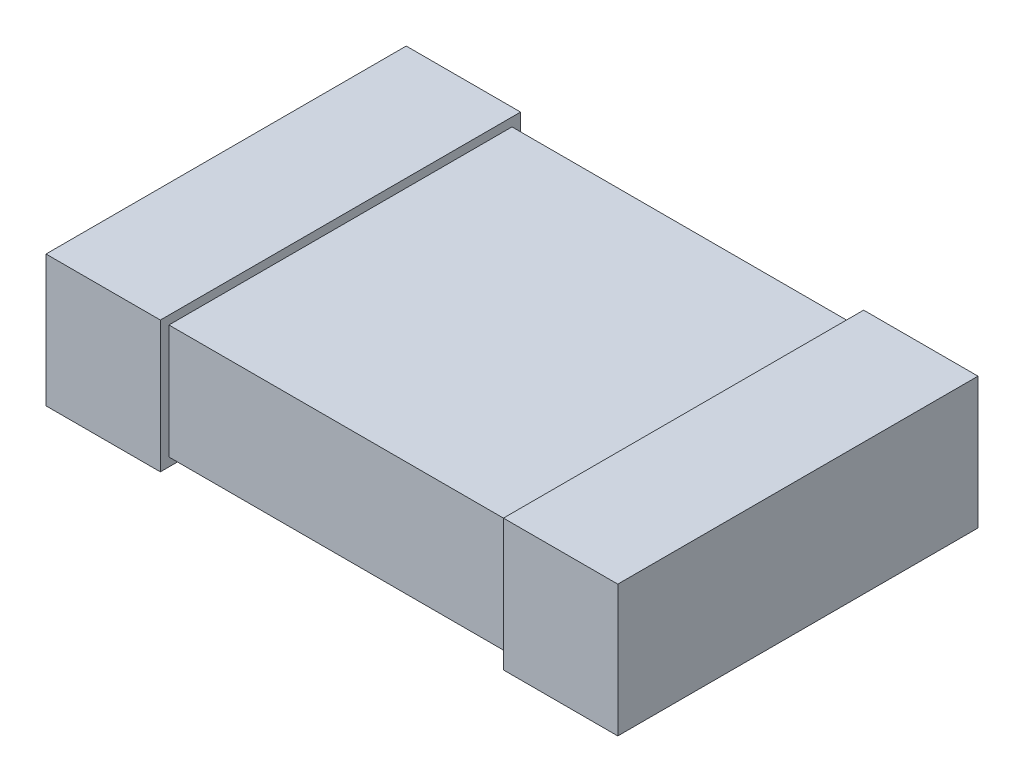
ISO-10303-21;
HEADER;
FILE_DESCRIPTION(('STEP AP214'),'2;1');
FILE_NAME('part.step','',(''),(''),'','','');
FILE_SCHEMA(('AUTOMOTIVE_DESIGN { 1 0 10303 214 1 1 1 1 }'));
ENDSEC;
DATA;
#1=APPLICATION_CONTEXT('core data for automotive mechanical design processes');
#2=APPLICATION_PROTOCOL_DEFINITION('international standard','automotive_design',2000,#1);
#3=PRODUCT_CONTEXT('',#1,'mechanical');
#4=PRODUCT('Part','Part','',(#3));
#5=PRODUCT_RELATED_PRODUCT_CATEGORY('part','',(#4));
#6=PRODUCT_DEFINITION_FORMATION('','',#4);
#7=PRODUCT_DEFINITION_CONTEXT('part definition',#1,'design');
#8=PRODUCT_DEFINITION('design','',#6,#7);
#9=PRODUCT_DEFINITION_SHAPE('','',#8);
#10=(LENGTH_UNIT() NAMED_UNIT(*) SI_UNIT(.MILLI.,.METRE.));
#11=(NAMED_UNIT(*) PLANE_ANGLE_UNIT() SI_UNIT($,.RADIAN.));
#12=(NAMED_UNIT(*) SI_UNIT($,.STERADIAN.) SOLID_ANGLE_UNIT());
#13=UNCERTAINTY_MEASURE_WITH_UNIT(LENGTH_MEASURE(1.E-05),#10,'distance_accuracy_value','');
#14=(GEOMETRIC_REPRESENTATION_CONTEXT(3) GLOBAL_UNCERTAINTY_ASSIGNED_CONTEXT((#13)) GLOBAL_UNIT_ASSIGNED_CONTEXT((#10,
#11,#12)) REPRESENTATION_CONTEXT('',''));
#15=CARTESIAN_POINT('',(0.,0.,0.));
#16=DIRECTION('',(0.,0.,1.));
#17=DIRECTION('',(1.,0.,0.));
#18=AXIS2_PLACEMENT_3D('',#15,#16,#17);
#19=CARTESIAN_POINT('',(-1.,0.4,0.6));
#20=DIRECTION('',(0.,0.,-1.));
#21=DIRECTION('',(-1.,0.,0.));
#22=AXIS2_PLACEMENT_3D('',#19,#20,#21);
#23=PLANE('',#22);
#24=DIRECTION('',(0.,-1.,0.));
#25=VECTOR('',#24,1.);
#26=CARTESIAN_POINT('',(0.6,0.4,0.6));
#27=LINE('',#26,#25);
#28=CARTESIAN_POINT('',(0.6,0.4,0.6));
#29=VERTEX_POINT('',#28);
#30=CARTESIAN_POINT('',(0.6,0.,0.6));
#31=VERTEX_POINT('',#30);
#32=EDGE_CURVE('E53',#29,#31,#27,.T.);
#33=ORIENTED_EDGE('',*,*,#32,.F.);
#34=DIRECTION('',(1.,0.,0.));
#35=VECTOR('',#34,1.);
#36=CARTESIAN_POINT('',(-1.,0.4,0.6));
#37=LINE('',#36,#35);
#38=CARTESIAN_POINT('',(-0.6,0.4,0.6));
#39=VERTEX_POINT('',#38);
#40=EDGE_CURVE('E218',#39,#29,#37,.T.);
#41=ORIENTED_EDGE('',*,*,#40,.F.);
#42=DIRECTION('',(0.,1.,0.));
#43=VECTOR('',#42,1.);
#44=CARTESIAN_POINT('',(-0.6,0.4,0.6));
#45=LINE('',#44,#43);
#46=CARTESIAN_POINT('',(-0.6,0.,0.6));
#47=VERTEX_POINT('',#46);
#48=EDGE_CURVE('E212',#47,#39,#45,.T.);
#49=ORIENTED_EDGE('',*,*,#48,.F.);
#50=DIRECTION('',(1.,0.,0.));
#51=VECTOR('',#50,1.);
#52=CARTESIAN_POINT('',(-1.,0.,0.6));
#53=LINE('',#52,#51);
#54=EDGE_CURVE('E217',#47,#31,#53,.T.);
#55=ORIENTED_EDGE('',*,*,#54,.T.);
#56=EDGE_LOOP('',(#33,#41,#49,#55));
#57=FACE_BOUND('',#56,.T.);
#58=ADVANCED_FACE('F38',(#57),#23,.F.);
#59=CARTESIAN_POINT('',(-1.,0.4,-0.6));
#60=DIRECTION('',(0.,0.,1.));
#61=DIRECTION('',(1.,0.,0.));
#62=AXIS2_PLACEMENT_3D('',#59,#60,#61);
#63=PLANE('',#62);
#64=DIRECTION('',(0.,1.,0.));
#65=VECTOR('',#64,1.);
#66=CARTESIAN_POINT('',(0.6,0.4,-0.6));
#67=LINE('',#66,#65);
#68=CARTESIAN_POINT('',(0.6,0.,-0.6));
#69=VERTEX_POINT('',#68);
#70=CARTESIAN_POINT('',(0.6,0.4,-0.6));
#71=VERTEX_POINT('',#70);
#72=EDGE_CURVE('E167',#69,#71,#67,.T.);
#73=ORIENTED_EDGE('',*,*,#72,.F.);
#74=DIRECTION('',(-1.,0.,0.));
#75=VECTOR('',#74,1.);
#76=CARTESIAN_POINT('',(-1.,0.,-0.6));
#77=LINE('',#76,#75);
#78=CARTESIAN_POINT('',(-0.6,0.,-0.6));
#79=VERTEX_POINT('',#78);
#80=EDGE_CURVE('E221',#69,#79,#77,.T.);
#81=ORIENTED_EDGE('',*,*,#80,.T.);
#82=DIRECTION('',(0.,-1.,0.));
#83=VECTOR('',#82,1.);
#84=CARTESIAN_POINT('',(-0.6,0.4,-0.6));
#85=LINE('',#84,#83);
#86=CARTESIAN_POINT('',(-0.6,0.4,-0.6));
#87=VERTEX_POINT('',#86);
#88=EDGE_CURVE('E200',#87,#79,#85,.T.);
#89=ORIENTED_EDGE('',*,*,#88,.F.);
#90=DIRECTION('',(-1.,0.,0.));
#91=VECTOR('',#90,1.);
#92=CARTESIAN_POINT('',(-1.,0.4,-0.6));
#93=LINE('',#92,#91);
#94=EDGE_CURVE('E220',#71,#87,#93,.T.);
#95=ORIENTED_EDGE('',*,*,#94,.F.);
#96=EDGE_LOOP('',(#73,#81,#89,#95));
#97=FACE_BOUND('',#96,.T.);
#98=ADVANCED_FACE('F238',(#97),#63,.F.);
#99=CARTESIAN_POINT('',(-1.,0.4,0.6));
#100=DIRECTION('',(0.,1.,0.));
#101=DIRECTION('',(0.,0.,1.));
#102=AXIS2_PLACEMENT_3D('',#99,#100,#101);
#103=PLANE('',#102);
#104=ORIENTED_EDGE('',*,*,#40,.T.);
#105=DIRECTION('',(0.,0.,-1.));
#106=VECTOR('',#105,1.);
#107=CARTESIAN_POINT('',(0.6,0.4,0.6));
#108=LINE('',#107,#106);
#109=EDGE_CURVE('E60',#29,#71,#108,.T.);
#110=ORIENTED_EDGE('',*,*,#109,.T.);
#111=ORIENTED_EDGE('',*,*,#94,.T.);
#112=DIRECTION('',(0.,0.,1.));
#113=VECTOR('',#112,1.);
#114=CARTESIAN_POINT('',(-0.6,0.4,0.6));
#115=LINE('',#114,#113);
#116=EDGE_CURVE('E215',#87,#39,#115,.T.);
#117=ORIENTED_EDGE('',*,*,#116,.T.);
#118=EDGE_LOOP('',(#104,#110,#111,#117));
#119=FACE_BOUND('',#118,.T.);
#120=ADVANCED_FACE('F235',(#119),#103,.T.);
#121=CARTESIAN_POINT('',(-1.,0.,0.6));
#122=DIRECTION('',(0.,1.,0.));
#123=DIRECTION('',(0.,0.,1.));
#124=AXIS2_PLACEMENT_3D('',#121,#122,#123);
#125=PLANE('',#124);
#126=DIRECTION('',(0.,0.,-1.));
#127=VECTOR('',#126,1.);
#128=CARTESIAN_POINT('',(0.6,0.,0.6));
#129=LINE('',#128,#127);
#130=EDGE_CURVE('E12',#31,#69,#129,.T.);
#131=ORIENTED_EDGE('',*,*,#130,.F.);
#132=ORIENTED_EDGE('',*,*,#54,.F.);
#133=DIRECTION('',(0.,0.,1.));
#134=VECTOR('',#133,1.);
#135=CARTESIAN_POINT('',(-0.6,0.,0.6));
#136=LINE('',#135,#134);
#137=EDGE_CURVE('E46',#79,#47,#136,.T.);
#138=ORIENTED_EDGE('',*,*,#137,.F.);
#139=ORIENTED_EDGE('',*,*,#80,.F.);
#140=EDGE_LOOP('',(#131,#132,#138,#139));
#141=FACE_BOUND('',#140,.T.);
#142=ADVANCED_FACE('F233',(#141),#125,.F.);
#143=CARTESIAN_POINT('',(-0.6,-0.0299999999999999,1.26959002616513));
#144=DIRECTION('',(0.,1.,0.));
#145=DIRECTION('',(-1.,0.,0.));
#146=AXIS2_PLACEMENT_3D('',#143,#144,#145);
#147=PLANE('',#146);
#148=DIRECTION('',(0.,0.,-1.));
#149=VECTOR('',#148,1.);
#150=CARTESIAN_POINT('',(-0.6,-0.0299999999999999,1.26959002616513));
#151=LINE('',#150,#149);
#152=CARTESIAN_POINT('',(-0.6,-0.0299999999999999,0.63));
#153=VERTEX_POINT('',#152);
#154=CARTESIAN_POINT('',(-0.6,-0.0299999999999999,-0.63));
#155=VERTEX_POINT('',#154);
#156=EDGE_CURVE('E189',#153,#155,#151,.T.);
#157=ORIENTED_EDGE('',*,*,#156,.F.);
#158=DIRECTION('',(-1.,0.,0.));
#159=VECTOR('',#158,1.);
#160=CARTESIAN_POINT('',(-0.6,-0.0299999999999999,0.63));
#161=LINE('',#160,#159);
#162=CARTESIAN_POINT('',(-1.,-0.03,0.63));
#163=VERTEX_POINT('',#162);
#164=EDGE_CURVE('E194',#153,#163,#161,.T.);
#165=ORIENTED_EDGE('',*,*,#164,.T.);
#166=DIRECTION('',(0.,0.,-1.));
#167=VECTOR('',#166,1.);
#168=CARTESIAN_POINT('',(-1.,-0.03,1.26959002616513));
#169=LINE('',#168,#167);
#170=CARTESIAN_POINT('',(-1.,-0.03,-0.63));
#171=VERTEX_POINT('',#170);
#172=EDGE_CURVE('E202',#163,#171,#169,.T.);
#173=ORIENTED_EDGE('',*,*,#172,.T.);
#174=DIRECTION('',(-1.,0.,0.));
#175=VECTOR('',#174,1.);
#176=CARTESIAN_POINT('',(-0.6,-0.0299999999999999,-0.63));
#177=LINE('',#176,#175);
#178=EDGE_CURVE('E180',#155,#171,#177,.T.);
#179=ORIENTED_EDGE('',*,*,#178,.F.);
#180=EDGE_LOOP('',(#157,#165,#173,#179));
#181=FACE_BOUND('',#180,.T.);
#182=ADVANCED_FACE('F279',(#181),#147,.F.);
#183=CARTESIAN_POINT('',(-0.6,0.43,1.26959002616513));
#184=DIRECTION('',(0.,-1.,0.));
#185=DIRECTION('',(1.,0.,0.));
#186=AXIS2_PLACEMENT_3D('',#183,#184,#185);
#187=PLANE('',#186);
#188=DIRECTION('',(0.,0.,-1.));
#189=VECTOR('',#188,1.);
#190=CARTESIAN_POINT('',(-1.,0.43,1.26959002616513));
#191=LINE('',#190,#189);
#192=CARTESIAN_POINT('',(-1.,0.43,0.63));
#193=VERTEX_POINT('',#192);
#194=CARTESIAN_POINT('',(-1.,0.43,-0.63));
#195=VERTEX_POINT('',#194);
#196=EDGE_CURVE('E204',#193,#195,#191,.T.);
#197=ORIENTED_EDGE('',*,*,#196,.F.);
#198=DIRECTION('',(1.,0.,0.));
#199=VECTOR('',#198,1.);
#200=CARTESIAN_POINT('',(-0.6,0.43,0.63));
#201=LINE('',#200,#199);
#202=CARTESIAN_POINT('',(-0.6,0.43,0.63));
#203=VERTEX_POINT('',#202);
#204=EDGE_CURVE('E193',#193,#203,#201,.T.);
#205=ORIENTED_EDGE('',*,*,#204,.T.);
#206=DIRECTION('',(0.,0.,-1.));
#207=VECTOR('',#206,1.);
#208=CARTESIAN_POINT('',(-0.6,0.43,1.26959002616513));
#209=LINE('',#208,#207);
#210=CARTESIAN_POINT('',(-0.6,0.43,-0.63));
#211=VERTEX_POINT('',#210);
#212=EDGE_CURVE('E206',#203,#211,#209,.T.);
#213=ORIENTED_EDGE('',*,*,#212,.T.);
#214=DIRECTION('',(1.,0.,0.));
#215=VECTOR('',#214,1.);
#216=CARTESIAN_POINT('',(-0.6,0.43,-0.63));
#217=LINE('',#216,#215);
#218=EDGE_CURVE('E186',#195,#211,#217,.T.);
#219=ORIENTED_EDGE('',*,*,#218,.F.);
#220=EDGE_LOOP('',(#197,#205,#213,#219));
#221=FACE_BOUND('',#220,.T.);
#222=ADVANCED_FACE('F282',(#221),#187,.F.);
#223=CARTESIAN_POINT('',(-0.6,0.43,1.26959002616513));
#224=DIRECTION('',(-1.,0.,0.));
#225=DIRECTION('',(0.,-1.,0.));
#226=AXIS2_PLACEMENT_3D('',#223,#224,#225);
#227=PLANE('',#226);
#228=ORIENTED_EDGE('',*,*,#116,.F.);
#229=ORIENTED_EDGE('',*,*,#88,.T.);
#230=ORIENTED_EDGE('',*,*,#137,.T.);
#231=ORIENTED_EDGE('',*,*,#48,.T.);
#232=EDGE_LOOP('',(#228,#229,#230,#231));
#233=FACE_BOUND('',#232,.T.);
#234=ORIENTED_EDGE('',*,*,#212,.F.);
#235=DIRECTION('',(0.,-1.,0.));
#236=VECTOR('',#235,1.);
#237=CARTESIAN_POINT('',(-0.6,0.43,0.63));
#238=LINE('',#237,#236);
#239=EDGE_CURVE('E197',#203,#153,#238,.T.);
#240=ORIENTED_EDGE('',*,*,#239,.T.);
#241=ORIENTED_EDGE('',*,*,#156,.T.);
#242=DIRECTION('',(0.,-1.,0.));
#243=VECTOR('',#242,1.);
#244=CARTESIAN_POINT('',(-0.6,0.43,-0.63));
#245=LINE('',#244,#243);
#246=EDGE_CURVE('E183',#211,#155,#245,.T.);
#247=ORIENTED_EDGE('',*,*,#246,.F.);
#248=EDGE_LOOP('',(#234,#240,#241,#247));
#249=FACE_BOUND('',#248,.T.);
#250=ADVANCED_FACE('F228',(#233,#249),#227,.F.);
#251=CARTESIAN_POINT('',(-1.,0.4,0.63));
#252=DIRECTION('',(0.,0.,-1.));
#253=DIRECTION('',(-1.,0.,0.));
#254=AXIS2_PLACEMENT_3D('',#251,#252,#253);
#255=PLANE('',#254);
#256=ORIENTED_EDGE('',*,*,#204,.F.);
#257=DIRECTION('',(0.,1.,0.));
#258=VECTOR('',#257,1.);
#259=CARTESIAN_POINT('',(-1.,0.43,0.63));
#260=LINE('',#259,#258);
#261=EDGE_CURVE('E190',#163,#193,#260,.T.);
#262=ORIENTED_EDGE('',*,*,#261,.F.);
#263=ORIENTED_EDGE('',*,*,#164,.F.);
#264=ORIENTED_EDGE('',*,*,#239,.F.);
#265=EDGE_LOOP('',(#256,#262,#263,#264));
#266=FACE_BOUND('',#265,.T.);
#267=ADVANCED_FACE('F274',(#266),#255,.F.);
#268=CARTESIAN_POINT('',(-1.,0.4,-0.63));
#269=DIRECTION('',(0.,0.,1.));
#270=DIRECTION('',(1.,0.,0.));
#271=AXIS2_PLACEMENT_3D('',#268,#269,#270);
#272=PLANE('',#271);
#273=ORIENTED_EDGE('',*,*,#246,.T.);
#274=ORIENTED_EDGE('',*,*,#178,.T.);
#275=DIRECTION('',(0.,1.,0.));
#276=VECTOR('',#275,1.);
#277=CARTESIAN_POINT('',(-1.,0.43,-0.63));
#278=LINE('',#277,#276);
#279=EDGE_CURVE('E177',#171,#195,#278,.T.);
#280=ORIENTED_EDGE('',*,*,#279,.T.);
#281=ORIENTED_EDGE('',*,*,#218,.T.);
#282=EDGE_LOOP('',(#273,#274,#280,#281));
#283=FACE_BOUND('',#282,.T.);
#284=ADVANCED_FACE('F271',(#283),#272,.F.);
#285=CARTESIAN_POINT('',(-1.,0.4,-0.6));
#286=DIRECTION('',(1.,0.,0.));
#287=DIRECTION('',(0.,0.,-1.));
#288=AXIS2_PLACEMENT_3D('',#285,#286,#287);
#289=PLANE('',#288);
#290=ORIENTED_EDGE('',*,*,#172,.F.);
#291=ORIENTED_EDGE('',*,*,#261,.T.);
#292=ORIENTED_EDGE('',*,*,#196,.T.);
#293=ORIENTED_EDGE('',*,*,#279,.F.);
#294=EDGE_LOOP('',(#290,#291,#292,#293));
#295=FACE_BOUND('',#294,.T.);
#296=ADVANCED_FACE('F40',(#295),#289,.F.);
#297=CARTESIAN_POINT('',(0.6,-0.0299999999999998,1.26959002616513));
#298=DIRECTION('',(0.,1.,0.));
#299=DIRECTION('',(-1.,0.,0.));
#300=AXIS2_PLACEMENT_3D('',#297,#298,#299);
#301=PLANE('',#300);
#302=DIRECTION('',(0.,0.,-1.));
#303=VECTOR('',#302,1.);
#304=CARTESIAN_POINT('',(1.,-0.0299999999999997,1.26959002616513));
#305=LINE('',#304,#303);
#306=CARTESIAN_POINT('',(1.,-0.0299999999999997,0.63));
#307=VERTEX_POINT('',#306);
#308=CARTESIAN_POINT('',(1.,-0.0299999999999997,-0.63));
#309=VERTEX_POINT('',#308);
#310=EDGE_CURVE('E140',#307,#309,#305,.T.);
#311=ORIENTED_EDGE('',*,*,#310,.F.);
#312=DIRECTION('',(-1.,0.,0.));
#313=VECTOR('',#312,1.);
#314=CARTESIAN_POINT('',(0.6,-0.0299999999999998,0.63));
#315=LINE('',#314,#313);
#316=CARTESIAN_POINT('',(0.6,-0.0299999999999998,0.63));
#317=VERTEX_POINT('',#316);
#318=EDGE_CURVE('E135',#307,#317,#315,.T.);
#319=ORIENTED_EDGE('',*,*,#318,.T.);
#320=DIRECTION('',(0.,0.,-1.));
#321=VECTOR('',#320,1.);
#322=CARTESIAN_POINT('',(0.6,-0.0299999999999998,1.26959002616513));
#323=LINE('',#322,#321);
#324=CARTESIAN_POINT('',(0.6,-0.0299999999999998,-0.63));
#325=VERTEX_POINT('',#324);
#326=EDGE_CURVE('E130',#317,#325,#323,.T.);
#327=ORIENTED_EDGE('',*,*,#326,.T.);
#328=DIRECTION('',(-1.,0.,0.));
#329=VECTOR('',#328,1.);
#330=CARTESIAN_POINT('',(0.6,-0.0299999999999998,-0.63));
#331=LINE('',#330,#329);
#332=EDGE_CURVE('E134',#309,#325,#331,.T.);
#333=ORIENTED_EDGE('',*,*,#332,.F.);
#334=EDGE_LOOP('',(#311,#319,#327,#333));
#335=FACE_BOUND('',#334,.T.);
#336=ADVANCED_FACE('F133',(#335),#301,.F.);
#337=CARTESIAN_POINT('',(0.6,0.43,1.26959002616513));
#338=DIRECTION('',(1.,0.,0.));
#339=DIRECTION('',(0.,1.,0.));
#340=AXIS2_PLACEMENT_3D('',#337,#338,#339);
#341=PLANE('',#340);
#342=ORIENTED_EDGE('',*,*,#109,.F.);
#343=ORIENTED_EDGE('',*,*,#32,.T.);
#344=ORIENTED_EDGE('',*,*,#130,.T.);
#345=ORIENTED_EDGE('',*,*,#72,.T.);
#346=EDGE_LOOP('',(#342,#343,#344,#345));
#347=FACE_BOUND('',#346,.T.);
#348=ORIENTED_EDGE('',*,*,#326,.F.);
#349=DIRECTION('',(0.,1.,0.));
#350=VECTOR('',#349,1.);
#351=CARTESIAN_POINT('',(0.6,0.43,0.63));
#352=LINE('',#351,#350);
#353=CARTESIAN_POINT('',(0.6,0.43,0.63));
#354=VERTEX_POINT('',#353);
#355=EDGE_CURVE('E162',#317,#354,#352,.T.);
#356=ORIENTED_EDGE('',*,*,#355,.T.);
#357=DIRECTION('',(0.,0.,-1.));
#358=VECTOR('',#357,1.);
#359=CARTESIAN_POINT('',(0.6,0.43,1.26959002616513));
#360=LINE('',#359,#358);
#361=CARTESIAN_POINT('',(0.6,0.43,-0.63));
#362=VERTEX_POINT('',#361);
#363=EDGE_CURVE('E139',#354,#362,#360,.T.);
#364=ORIENTED_EDGE('',*,*,#363,.T.);
#365=DIRECTION('',(0.,1.,0.));
#366=VECTOR('',#365,1.);
#367=CARTESIAN_POINT('',(0.6,0.43,-0.63));
#368=LINE('',#367,#366);
#369=EDGE_CURVE('E147',#325,#362,#368,.T.);
#370=ORIENTED_EDGE('',*,*,#369,.F.);
#371=EDGE_LOOP('',(#348,#356,#364,#370));
#372=FACE_BOUND('',#371,.T.);
#373=ADVANCED_FACE('F152',(#347,#372),#341,.F.);
#374=CARTESIAN_POINT('',(0.6,0.43,1.26959002616513));
#375=DIRECTION('',(0.,-1.,0.));
#376=DIRECTION('',(1.,0.,0.));
#377=AXIS2_PLACEMENT_3D('',#374,#375,#376);
#378=PLANE('',#377);
#379=ORIENTED_EDGE('',*,*,#363,.F.);
#380=DIRECTION('',(1.,0.,0.));
#381=VECTOR('',#380,1.);
#382=CARTESIAN_POINT('',(0.6,0.43,0.63));
#383=LINE('',#382,#381);
#384=CARTESIAN_POINT('',(1.,0.43,0.63));
#385=VERTEX_POINT('',#384);
#386=EDGE_CURVE('E165',#354,#385,#383,.T.);
#387=ORIENTED_EDGE('',*,*,#386,.T.);
#388=DIRECTION('',(0.,0.,-1.));
#389=VECTOR('',#388,1.);
#390=CARTESIAN_POINT('',(1.,0.43,1.26959002616513));
#391=LINE('',#390,#389);
#392=CARTESIAN_POINT('',(1.,0.43,-0.63));
#393=VERTEX_POINT('',#392);
#394=EDGE_CURVE('E154',#385,#393,#391,.T.);
#395=ORIENTED_EDGE('',*,*,#394,.T.);
#396=DIRECTION('',(1.,0.,0.));
#397=VECTOR('',#396,1.);
#398=CARTESIAN_POINT('',(0.6,0.43,-0.63));
#399=LINE('',#398,#397);
#400=EDGE_CURVE('E155',#362,#393,#399,.T.);
#401=ORIENTED_EDGE('',*,*,#400,.F.);
#402=EDGE_LOOP('',(#379,#387,#395,#401));
#403=FACE_BOUND('',#402,.T.);
#404=ADVANCED_FACE('F258',(#403),#378,.F.);
#405=CARTESIAN_POINT('',(-1.,0.4,0.63));
#406=DIRECTION('',(0.,0.,-1.));
#407=DIRECTION('',(-1.,0.,0.));
#408=AXIS2_PLACEMENT_3D('',#405,#406,#407);
#409=PLANE('',#408);
#410=ORIENTED_EDGE('',*,*,#355,.F.);
#411=ORIENTED_EDGE('',*,*,#318,.F.);
#412=DIRECTION('',(0.,-1.,0.));
#413=VECTOR('',#412,1.);
#414=CARTESIAN_POINT('',(1.,0.43,0.63));
#415=LINE('',#414,#413);
#416=EDGE_CURVE('E163',#385,#307,#415,.T.);
#417=ORIENTED_EDGE('',*,*,#416,.F.);
#418=ORIENTED_EDGE('',*,*,#386,.F.);
#419=EDGE_LOOP('',(#410,#411,#417,#418));
#420=FACE_BOUND('',#419,.T.);
#421=ADVANCED_FACE('F254',(#420),#409,.F.);
#422=CARTESIAN_POINT('',(-1.,0.4,-0.63));
#423=DIRECTION('',(0.,0.,1.));
#424=DIRECTION('',(1.,0.,0.));
#425=AXIS2_PLACEMENT_3D('',#422,#423,#424);
#426=PLANE('',#425);
#427=ORIENTED_EDGE('',*,*,#400,.T.);
#428=DIRECTION('',(0.,-1.,0.));
#429=VECTOR('',#428,1.);
#430=CARTESIAN_POINT('',(1.,0.43,-0.63));
#431=LINE('',#430,#429);
#432=EDGE_CURVE('E150',#393,#309,#431,.T.);
#433=ORIENTED_EDGE('',*,*,#432,.T.);
#434=ORIENTED_EDGE('',*,*,#332,.T.);
#435=ORIENTED_EDGE('',*,*,#369,.T.);
#436=EDGE_LOOP('',(#427,#433,#434,#435));
#437=FACE_BOUND('',#436,.T.);
#438=ADVANCED_FACE('F146',(#437),#426,.F.);
#439=CARTESIAN_POINT('',(1.,0.4,-0.6));
#440=DIRECTION('',(-1.,0.,0.));
#441=DIRECTION('',(0.,0.,1.));
#442=AXIS2_PLACEMENT_3D('',#439,#440,#441);
#443=PLANE('',#442);
#444=ORIENTED_EDGE('',*,*,#394,.F.);
#445=ORIENTED_EDGE('',*,*,#416,.T.);
#446=ORIENTED_EDGE('',*,*,#310,.T.);
#447=ORIENTED_EDGE('',*,*,#432,.F.);
#448=EDGE_LOOP('',(#444,#445,#446,#447));
#449=FACE_BOUND('',#448,.T.);
#450=ADVANCED_FACE('F248',(#449),#443,.F.);
#451=CLOSED_SHELL('',(#58,#98,#120,#142,#182,#222,#250,#267,#284,#296,#336,#373,#404,#421,#438,#450));
#452=MANIFOLD_SOLID_BREP('B2',#451);
#453=ADVANCED_BREP_SHAPE_REPRESENTATION('',(#18,#452),#14);
#454=SHAPE_DEFINITION_REPRESENTATION(#9,#453);
ENDSEC;
END-ISO-10303-21;
